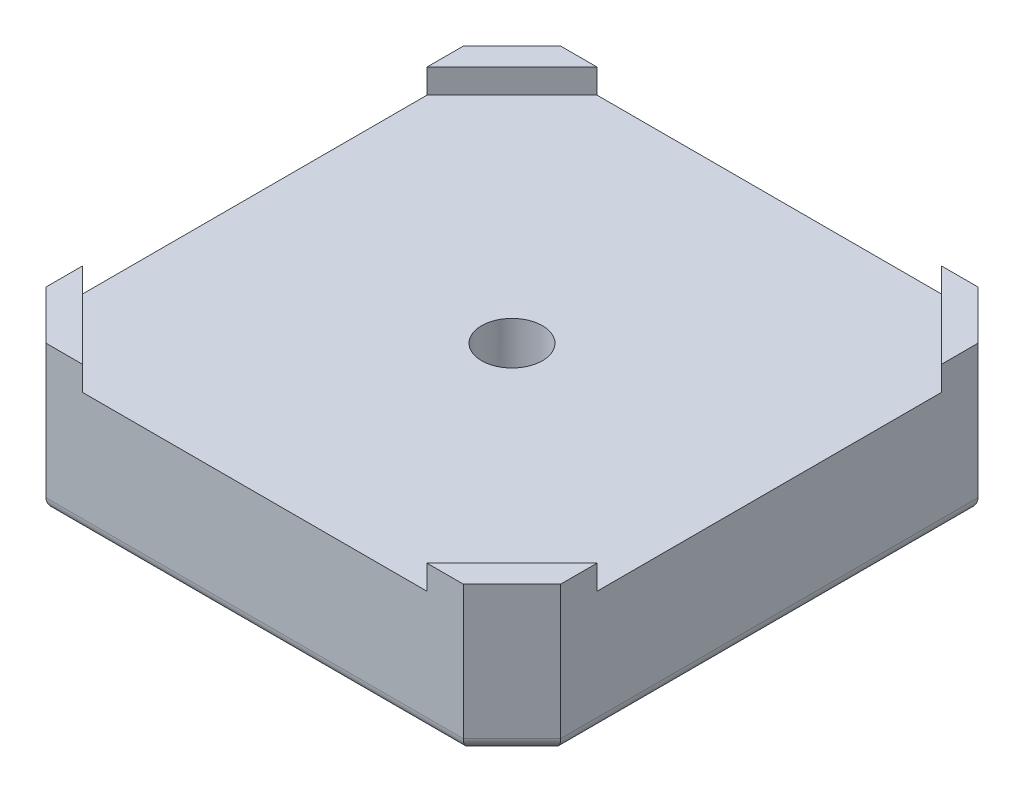
ISO-10303-21;
HEADER;
FILE_DESCRIPTION(('STEP AP214'),'2;1');
FILE_NAME('part.step','',(''),(''),'','','');
FILE_SCHEMA(('AUTOMOTIVE_DESIGN { 1 0 10303 214 1 1 1 1 }'));
ENDSEC;
DATA;
#1=APPLICATION_CONTEXT('core data for automotive mechanical design processes');
#2=APPLICATION_PROTOCOL_DEFINITION('international standard','automotive_design',2000,#1);
#3=PRODUCT_CONTEXT('',#1,'mechanical');
#4=PRODUCT('Part','Part','',(#3));
#5=PRODUCT_RELATED_PRODUCT_CATEGORY('part','',(#4));
#6=PRODUCT_DEFINITION_FORMATION('','',#4);
#7=PRODUCT_DEFINITION_CONTEXT('part definition',#1,'design');
#8=PRODUCT_DEFINITION('design','',#6,#7);
#9=PRODUCT_DEFINITION_SHAPE('','',#8);
#10=(LENGTH_UNIT() NAMED_UNIT(*) SI_UNIT(.MILLI.,.METRE.));
#11=(NAMED_UNIT(*) PLANE_ANGLE_UNIT() SI_UNIT($,.RADIAN.));
#12=(NAMED_UNIT(*) SI_UNIT($,.STERADIAN.) SOLID_ANGLE_UNIT());
#13=UNCERTAINTY_MEASURE_WITH_UNIT(LENGTH_MEASURE(1.E-05),#10,'distance_accuracy_value','');
#14=(GEOMETRIC_REPRESENTATION_CONTEXT(3) GLOBAL_UNCERTAINTY_ASSIGNED_CONTEXT((#13)) GLOBAL_UNIT_ASSIGNED_CONTEXT((#10,
#11,#12)) REPRESENTATION_CONTEXT('',''));
#15=CARTESIAN_POINT('',(0.,0.,0.));
#16=DIRECTION('',(0.,0.,1.));
#17=DIRECTION('',(1.,0.,0.));
#18=AXIS2_PLACEMENT_3D('',#15,#16,#17);
#19=CARTESIAN_POINT('',(0.,0.,0.));
#20=DIRECTION('',(0.,1.,0.));
#21=DIRECTION('',(0.,0.,1.));
#22=AXIS2_PLACEMENT_3D('',#19,#20,#21);
#23=PLANE('',#22);
#24=CARTESIAN_POINT('',(15.5,0.,-15.5));
#25=DIRECTION('',(0.,1.,0.));
#26=DIRECTION('',(0.,0.,1.));
#27=AXIS2_PLACEMENT_3D('',#24,#25,#26);
#28=CIRCLE('',#27,1.55);
#29=CARTESIAN_POINT('',(15.5,0.,-13.95));
#30=VERTEX_POINT('',#29);
#31=EDGE_CURVE('E482',#30,#30,#28,.T.);
#32=ORIENTED_EDGE('',*,*,#31,.T.);
#33=EDGE_LOOP('',(#32));
#34=FACE_BOUND('',#33,.T.);
#35=CARTESIAN_POINT('',(15.5,0.,15.5));
#36=DIRECTION('',(0.,1.,0.));
#37=DIRECTION('',(0.,0.,1.));
#38=AXIS2_PLACEMENT_3D('',#35,#36,#37);
#39=CIRCLE('',#38,1.55);
#40=CARTESIAN_POINT('',(15.5,0.,17.05));
#41=VERTEX_POINT('',#40);
#42=EDGE_CURVE('E478',#41,#41,#39,.T.);
#43=ORIENTED_EDGE('',*,*,#42,.T.);
#44=EDGE_LOOP('',(#43));
#45=FACE_BOUND('',#44,.T.);
#46=CARTESIAN_POINT('',(-15.5,0.,-15.5));
#47=DIRECTION('',(0.,1.,0.));
#48=DIRECTION('',(0.,0.,1.));
#49=AXIS2_PLACEMENT_3D('',#46,#47,#48);
#50=CIRCLE('',#49,1.55);
#51=CARTESIAN_POINT('',(-15.5,0.,-13.95));
#52=VERTEX_POINT('',#51);
#53=EDGE_CURVE('E474',#52,#52,#50,.T.);
#54=ORIENTED_EDGE('',*,*,#53,.T.);
#55=EDGE_LOOP('',(#54));
#56=FACE_BOUND('',#55,.T.);
#57=CARTESIAN_POINT('',(-15.5,0.,15.5));
#58=DIRECTION('',(0.,1.,0.));
#59=DIRECTION('',(0.,0.,1.));
#60=AXIS2_PLACEMENT_3D('',#57,#58,#59);
#61=CIRCLE('',#60,1.55);
#62=CARTESIAN_POINT('',(-15.5,0.,17.05));
#63=VERTEX_POINT('',#62);
#64=EDGE_CURVE('E470',#63,#63,#61,.T.);
#65=ORIENTED_EDGE('',*,*,#64,.T.);
#66=EDGE_LOOP('',(#65));
#67=FACE_BOUND('',#66,.T.);
#68=CARTESIAN_POINT('',(0.,0.,0.));
#69=DIRECTION('',(0.,1.,0.));
#70=DIRECTION('',(0.,0.,1.));
#71=AXIS2_PLACEMENT_3D('',#68,#69,#70);
#72=CIRCLE('',#71,11.5);
#73=CARTESIAN_POINT('',(0.,0.,11.5));
#74=VERTEX_POINT('',#73);
#75=EDGE_CURVE('E462',#74,#74,#72,.T.);
#76=ORIENTED_EDGE('',*,*,#75,.T.);
#77=EDGE_LOOP('',(#76));
#78=FACE_BOUND('',#77,.T.);
#79=DIRECTION('',(0.,0.,1.));
#80=VECTOR('',#79,1.);
#81=CARTESIAN_POINT('',(-20.15,0.,0.));
#82=LINE('',#81,#80);
#83=CARTESIAN_POINT('',(-20.15,0.,16.7357864376269));
#84=VERTEX_POINT('',#83);
#85=CARTESIAN_POINT('',(-20.15,0.,-16.7357864376269));
#86=VERTEX_POINT('',#85);
#87=EDGE_CURVE('E370',#84,#86,#82,.F.);
#88=ORIENTED_EDGE('',*,*,#87,.T.);
#89=DIRECTION('',(-0.707106781186548,0.,0.707106781186548));
#90=VECTOR('',#89,1.);
#91=CARTESIAN_POINT('',(-18.4428932188135,0.,-18.4428932188135));
#92=LINE('',#91,#90);
#93=CARTESIAN_POINT('',(-16.7357864376269,0.,-20.15));
#94=VERTEX_POINT('',#93);
#95=EDGE_CURVE('E391',#86,#94,#92,.F.);
#96=ORIENTED_EDGE('',*,*,#95,.T.);
#97=DIRECTION('',(-1.,0.,0.));
#98=VECTOR('',#97,1.);
#99=CARTESIAN_POINT('',(0.,0.,-20.15));
#100=LINE('',#99,#98);
#101=CARTESIAN_POINT('',(16.7357864376269,0.,-20.15));
#102=VERTEX_POINT('',#101);
#103=EDGE_CURVE('E388',#94,#102,#100,.F.);
#104=ORIENTED_EDGE('',*,*,#103,.T.);
#105=DIRECTION('',(-0.707106781186548,0.,-0.707106781186548));
#106=VECTOR('',#105,1.);
#107=CARTESIAN_POINT('',(18.4428932188134,0.,-18.4428932188134));
#108=LINE('',#107,#106);
#109=CARTESIAN_POINT('',(20.15,0.,-16.7357864376269));
#110=VERTEX_POINT('',#109);
#111=EDGE_CURVE('E385',#102,#110,#108,.F.);
#112=ORIENTED_EDGE('',*,*,#111,.T.);
#113=DIRECTION('',(0.,0.,-1.));
#114=VECTOR('',#113,1.);
#115=CARTESIAN_POINT('',(20.15,0.,0.));
#116=LINE('',#115,#114);
#117=CARTESIAN_POINT('',(20.15,0.,16.7357864376269));
#118=VERTEX_POINT('',#117);
#119=EDGE_CURVE('E382',#110,#118,#116,.F.);
#120=ORIENTED_EDGE('',*,*,#119,.T.);
#121=DIRECTION('',(0.707106781186548,0.,-0.707106781186548));
#122=VECTOR('',#121,1.);
#123=CARTESIAN_POINT('',(18.4428932188134,0.,18.4428932188134));
#124=LINE('',#123,#122);
#125=CARTESIAN_POINT('',(16.7357864376269,0.,20.15));
#126=VERTEX_POINT('',#125);
#127=EDGE_CURVE('E379',#118,#126,#124,.F.);
#128=ORIENTED_EDGE('',*,*,#127,.T.);
#129=DIRECTION('',(1.,0.,0.));
#130=VECTOR('',#129,1.);
#131=CARTESIAN_POINT('',(0.,0.,20.15));
#132=LINE('',#131,#130);
#133=CARTESIAN_POINT('',(-16.7357864376269,0.,20.15));
#134=VERTEX_POINT('',#133);
#135=EDGE_CURVE('E376',#126,#134,#132,.F.);
#136=ORIENTED_EDGE('',*,*,#135,.T.);
#137=DIRECTION('',(0.707106781186548,0.,0.707106781186548));
#138=VECTOR('',#137,1.);
#139=CARTESIAN_POINT('',(-18.4428932188135,0.,18.4428932188135));
#140=LINE('',#139,#138);
#141=EDGE_CURVE('E373',#134,#84,#140,.F.);
#142=ORIENTED_EDGE('',*,*,#141,.T.);
#143=EDGE_LOOP('',(#88,#96,#104,#112,#120,#128,#136,#142));
#144=FACE_BOUND('',#143,.T.);
#145=ADVANCED_FACE('F44',(#34,#45,#56,#67,#78,#144),#23,.F.);
#146=CARTESIAN_POINT('',(0.,0.,0.));
#147=DIRECTION('',(0.,1.,0.));
#148=DIRECTION('',(0.,0.,1.));
#149=AXIS2_PLACEMENT_3D('',#146,#147,#148);
#150=CYLINDRICAL_SURFACE('',#149,2.5);
#151=CARTESIAN_POINT('',(0.,10.,0.));
#152=DIRECTION('',(0.,1.,0.));
#153=DIRECTION('',(0.,0.,1.));
#154=AXIS2_PLACEMENT_3D('',#151,#152,#153);
#155=CIRCLE('',#154,2.5);
#156=CARTESIAN_POINT('',(0.,10.,2.5));
#157=VERTEX_POINT('',#156);
#158=EDGE_CURVE('E249',#157,#157,#155,.T.);
#159=ORIENTED_EDGE('',*,*,#158,.T.);
#160=EDGE_LOOP('',(#159));
#161=FACE_BOUND('',#160,.T.);
#162=CARTESIAN_POINT('',(0.,5.,0.));
#163=DIRECTION('',(0.,-1.,0.));
#164=DIRECTION('',(0.,0.,-1.));
#165=AXIS2_PLACEMENT_3D('',#162,#163,#164);
#166=CIRCLE('',#165,2.5);
#167=CARTESIAN_POINT('',(0.,5.,-2.5));
#168=VERTEX_POINT('',#167);
#169=EDGE_CURVE('E247',#168,#168,#166,.F.);
#170=ORIENTED_EDGE('',*,*,#169,.F.);
#171=EDGE_LOOP('',(#170));
#172=FACE_BOUND('',#171,.T.);
#173=ADVANCED_FACE('F510',(#161,#172),#150,.F.);
#174=CARTESIAN_POINT('',(0.,12.,0.));
#175=DIRECTION('',(0.,1.,0.));
#176=DIRECTION('',(0.,0.,1.));
#177=AXIS2_PLACEMENT_3D('',#174,#175,#176);
#178=PLANE('',#177);
#179=DIRECTION('',(-0.707106781186547,0.,0.707106781186547));
#180=VECTOR('',#179,1.);
#181=CARTESIAN_POINT('',(-21.15,12.,-14.15));
#182=LINE('',#181,#180);
#183=CARTESIAN_POINT('',(-14.15,12.,-21.15));
#184=VERTEX_POINT('',#183);
#185=CARTESIAN_POINT('',(-21.15,12.,-14.15));
#186=VERTEX_POINT('',#185);
#187=EDGE_CURVE('E252',#184,#186,#182,.T.);
#188=ORIENTED_EDGE('',*,*,#187,.F.);
#189=DIRECTION('',(-1.,0.,0.));
#190=VECTOR('',#189,1.);
#191=CARTESIAN_POINT('',(-17.15,12.,-21.15));
#192=LINE('',#191,#190);
#193=CARTESIAN_POINT('',(-17.15,12.,-21.15));
#194=VERTEX_POINT('',#193);
#195=EDGE_CURVE('E291',#184,#194,#192,.T.);
#196=ORIENTED_EDGE('',*,*,#195,.T.);
#197=DIRECTION('',(-0.707106781186548,0.,0.707106781186548));
#198=VECTOR('',#197,1.);
#199=CARTESIAN_POINT('',(-21.15,12.,-17.15));
#200=LINE('',#199,#198);
#201=CARTESIAN_POINT('',(-21.15,12.,-17.15));
#202=VERTEX_POINT('',#201);
#203=EDGE_CURVE('E315',#194,#202,#200,.T.);
#204=ORIENTED_EDGE('',*,*,#203,.T.);
#205=DIRECTION('',(0.,0.,1.));
#206=VECTOR('',#205,1.);
#207=CARTESIAN_POINT('',(-21.15,12.,17.15));
#208=LINE('',#207,#206);
#209=EDGE_CURVE('E318',#202,#186,#208,.T.);
#210=ORIENTED_EDGE('',*,*,#209,.T.);
#211=EDGE_LOOP('',(#188,#196,#204,#210));
#212=FACE_BOUND('',#211,.T.);
#213=ADVANCED_FACE('F516',(#212),#178,.T.);
#214=DIRECTION('',(-0.707106781186547,0.,-0.707106781186547));
#215=VECTOR('',#214,1.);
#216=CARTESIAN_POINT('',(21.15,12.,-14.15));
#217=LINE('',#216,#215);
#218=CARTESIAN_POINT('',(21.15,12.,-14.15));
#219=VERTEX_POINT('',#218);
#220=CARTESIAN_POINT('',(14.15,12.,-21.15));
#221=VERTEX_POINT('',#220);
#222=EDGE_CURVE('E257',#219,#221,#217,.T.);
#223=ORIENTED_EDGE('',*,*,#222,.F.);
#224=DIRECTION('',(0.,0.,-1.));
#225=VECTOR('',#224,1.);
#226=CARTESIAN_POINT('',(21.15,12.,17.15));
#227=LINE('',#226,#225);
#228=CARTESIAN_POINT('',(21.15,12.,-17.15));
#229=VERTEX_POINT('',#228);
#230=EDGE_CURVE('E329',#219,#229,#227,.T.);
#231=ORIENTED_EDGE('',*,*,#230,.T.);
#232=DIRECTION('',(-0.707106781186548,0.,-0.707106781186548));
#233=VECTOR('',#232,1.);
#234=CARTESIAN_POINT('',(21.15,12.,-17.15));
#235=LINE('',#234,#233);
#236=CARTESIAN_POINT('',(17.15,12.,-21.15));
#237=VERTEX_POINT('',#236);
#238=EDGE_CURVE('E333',#229,#237,#235,.T.);
#239=ORIENTED_EDGE('',*,*,#238,.T.);
#240=EDGE_CURVE('E311',#237,#221,#192,.T.);
#241=ORIENTED_EDGE('',*,*,#240,.T.);
#242=EDGE_LOOP('',(#223,#231,#239,#241));
#243=FACE_BOUND('',#242,.T.);
#244=ADVANCED_FACE('F705',(#243),#178,.T.);
#245=DIRECTION('',(0.707106781186547,0.,-0.707106781186547));
#246=VECTOR('',#245,1.);
#247=CARTESIAN_POINT('',(14.15,12.,21.15));
#248=LINE('',#247,#246);
#249=CARTESIAN_POINT('',(14.15,12.,21.15));
#250=VERTEX_POINT('',#249);
#251=CARTESIAN_POINT('',(21.15,12.,14.15));
#252=VERTEX_POINT('',#251);
#253=EDGE_CURVE('E285',#250,#252,#248,.T.);
#254=ORIENTED_EDGE('',*,*,#253,.F.);
#255=DIRECTION('',(1.,0.,0.));
#256=VECTOR('',#255,1.);
#257=CARTESIAN_POINT('',(-17.15,12.,21.15));
#258=LINE('',#257,#256);
#259=CARTESIAN_POINT('',(17.15,12.,21.15));
#260=VERTEX_POINT('',#259);
#261=EDGE_CURVE('E323',#250,#260,#258,.T.);
#262=ORIENTED_EDGE('',*,*,#261,.T.);
#263=DIRECTION('',(0.707106781186548,0.,-0.707106781186548));
#264=VECTOR('',#263,1.);
#265=CARTESIAN_POINT('',(17.15,12.,21.15));
#266=LINE('',#265,#264);
#267=CARTESIAN_POINT('',(21.15,12.,17.15));
#268=VERTEX_POINT('',#267);
#269=EDGE_CURVE('E327',#260,#268,#266,.T.);
#270=ORIENTED_EDGE('',*,*,#269,.T.);
#271=EDGE_CURVE('E330',#268,#252,#227,.T.);
#272=ORIENTED_EDGE('',*,*,#271,.T.);
#273=EDGE_LOOP('',(#254,#262,#270,#272));
#274=FACE_BOUND('',#273,.T.);
#275=ADVANCED_FACE('F553',(#274),#178,.T.);
#276=CARTESIAN_POINT('',(-17.15,12.,-21.15));
#277=DIRECTION('',(0.,0.,1.));
#278=DIRECTION('',(1.,0.,0.));
#279=AXIS2_PLACEMENT_3D('',#276,#277,#278);
#280=PLANE('',#279);
#281=DIRECTION('',(0.,-1.,0.));
#282=VECTOR('',#281,1.);
#283=CARTESIAN_POINT('',(17.15,12.,-21.15));
#284=LINE('',#283,#282);
#285=CARTESIAN_POINT('',(17.15,1.,-21.15));
#286=VERTEX_POINT('',#285);
#287=EDGE_CURVE('E336',#237,#286,#284,.T.);
#288=ORIENTED_EDGE('',*,*,#287,.T.);
#289=DIRECTION('',(-1.,0.,0.));
#290=VECTOR('',#289,1.);
#291=CARTESIAN_POINT('',(-17.15,1.,-21.15));
#292=LINE('',#291,#290);
#293=CARTESIAN_POINT('',(-17.15,1.,-21.15));
#294=VERTEX_POINT('',#293);
#295=EDGE_CURVE('E395',#286,#294,#292,.T.);
#296=ORIENTED_EDGE('',*,*,#295,.T.);
#297=DIRECTION('',(0.,-1.,0.));
#298=VECTOR('',#297,1.);
#299=CARTESIAN_POINT('',(-17.15,12.,-21.15));
#300=LINE('',#299,#298);
#301=EDGE_CURVE('E360',#194,#294,#300,.T.);
#302=ORIENTED_EDGE('',*,*,#301,.F.);
#303=ORIENTED_EDGE('',*,*,#195,.F.);
#304=DIRECTION('',(0.,1.,0.));
#305=VECTOR('',#304,1.);
#306=CARTESIAN_POINT('',(-14.15,10.,-21.15));
#307=LINE('',#306,#305);
#308=CARTESIAN_POINT('',(-14.15,10.,-21.15));
#309=VERTEX_POINT('',#308);
#310=EDGE_CURVE('E289',#309,#184,#307,.T.);
#311=ORIENTED_EDGE('',*,*,#310,.F.);
#312=DIRECTION('',(-1.,0.,0.));
#313=VECTOR('',#312,1.);
#314=CARTESIAN_POINT('',(-14.15,10.,-21.15));
#315=LINE('',#314,#313);
#316=CARTESIAN_POINT('',(14.15,10.,-21.15));
#317=VERTEX_POINT('',#316);
#318=EDGE_CURVE('E277',#317,#309,#315,.T.);
#319=ORIENTED_EDGE('',*,*,#318,.F.);
#320=DIRECTION('',(0.,1.,0.));
#321=VECTOR('',#320,1.);
#322=CARTESIAN_POINT('',(14.15,10.,-21.15));
#323=LINE('',#322,#321);
#324=EDGE_CURVE('E292',#317,#221,#323,.T.);
#325=ORIENTED_EDGE('',*,*,#324,.T.);
#326=ORIENTED_EDGE('',*,*,#240,.F.);
#327=EDGE_LOOP('',(#288,#296,#302,#303,#311,#319,#325,#326));
#328=FACE_BOUND('',#327,.T.);
#329=ADVANCED_FACE('F549',(#328),#280,.F.);
#330=CARTESIAN_POINT('',(-21.15,12.,-17.15));
#331=DIRECTION('',(0.707106781186547,0.,0.707106781186547));
#332=DIRECTION('',(0.707106781186548,0.,-0.707106781186548));
#333=AXIS2_PLACEMENT_3D('',#330,#331,#332);
#334=PLANE('',#333);
#335=ORIENTED_EDGE('',*,*,#301,.T.);
#336=DIRECTION('',(-0.707106781186548,0.,0.707106781186548));
#337=VECTOR('',#336,1.);
#338=CARTESIAN_POINT('',(-21.15,1.,-17.15));
#339=LINE('',#338,#337);
#340=CARTESIAN_POINT('',(-21.15,1.,-17.15));
#341=VERTEX_POINT('',#340);
#342=EDGE_CURVE('E364',#294,#341,#339,.T.);
#343=ORIENTED_EDGE('',*,*,#342,.T.);
#344=DIRECTION('',(0.,-1.,0.));
#345=VECTOR('',#344,1.);
#346=CARTESIAN_POINT('',(-21.15,12.,-17.15));
#347=LINE('',#346,#345);
#348=EDGE_CURVE('E357',#202,#341,#347,.T.);
#349=ORIENTED_EDGE('',*,*,#348,.F.);
#350=ORIENTED_EDGE('',*,*,#203,.F.);
#351=EDGE_LOOP('',(#335,#343,#349,#350));
#352=FACE_BOUND('',#351,.T.);
#353=ADVANCED_FACE('F546',(#352),#334,.F.);
#354=CARTESIAN_POINT('',(-21.15,12.,17.15));
#355=DIRECTION('',(1.,0.,0.));
#356=DIRECTION('',(0.,0.,-1.));
#357=AXIS2_PLACEMENT_3D('',#354,#355,#356);
#358=PLANE('',#357);
#359=ORIENTED_EDGE('',*,*,#348,.T.);
#360=DIRECTION('',(0.,0.,1.));
#361=VECTOR('',#360,1.);
#362=CARTESIAN_POINT('',(-21.15,1.,17.15));
#363=LINE('',#362,#361);
#364=CARTESIAN_POINT('',(-21.15,1.,17.15));
#365=VERTEX_POINT('',#364);
#366=EDGE_CURVE('E63',#341,#365,#363,.T.);
#367=ORIENTED_EDGE('',*,*,#366,.T.);
#368=DIRECTION('',(0.,-1.,0.));
#369=VECTOR('',#368,1.);
#370=CARTESIAN_POINT('',(-21.15,12.,17.15));
#371=LINE('',#370,#369);
#372=CARTESIAN_POINT('',(-21.15,12.,17.15));
#373=VERTEX_POINT('',#372);
#374=EDGE_CURVE('E354',#373,#365,#371,.T.);
#375=ORIENTED_EDGE('',*,*,#374,.F.);
#376=CARTESIAN_POINT('',(-21.15,12.,14.15));
#377=VERTEX_POINT('',#376);
#378=EDGE_CURVE('E317',#377,#373,#208,.T.);
#379=ORIENTED_EDGE('',*,*,#378,.F.);
#380=DIRECTION('',(0.,1.,0.));
#381=VECTOR('',#380,1.);
#382=CARTESIAN_POINT('',(-21.15,10.,14.15));
#383=LINE('',#382,#381);
#384=CARTESIAN_POINT('',(-21.15,10.,14.15));
#385=VERTEX_POINT('',#384);
#386=EDGE_CURVE('E307',#385,#377,#383,.T.);
#387=ORIENTED_EDGE('',*,*,#386,.F.);
#388=DIRECTION('',(0.,0.,1.));
#389=VECTOR('',#388,1.);
#390=CARTESIAN_POINT('',(-21.15,10.,14.15));
#391=LINE('',#390,#389);
#392=CARTESIAN_POINT('',(-21.15,10.,-14.15));
#393=VERTEX_POINT('',#392);
#394=EDGE_CURVE('E256',#393,#385,#391,.T.);
#395=ORIENTED_EDGE('',*,*,#394,.F.);
#396=DIRECTION('',(0.,1.,0.));
#397=VECTOR('',#396,1.);
#398=CARTESIAN_POINT('',(-21.15,10.,-14.15));
#399=LINE('',#398,#397);
#400=EDGE_CURVE('E281',#393,#186,#399,.T.);
#401=ORIENTED_EDGE('',*,*,#400,.T.);
#402=ORIENTED_EDGE('',*,*,#209,.F.);
#403=EDGE_LOOP('',(#359,#367,#375,#379,#387,#395,#401,#402));
#404=FACE_BOUND('',#403,.T.);
#405=ADVANCED_FACE('F543',(#404),#358,.F.);
#406=CARTESIAN_POINT('',(-21.15,12.,17.15));
#407=DIRECTION('',(0.707106781186547,0.,-0.707106781186547));
#408=DIRECTION('',(-0.707106781186548,0.,-0.707106781186548));
#409=AXIS2_PLACEMENT_3D('',#406,#407,#408);
#410=PLANE('',#409);
#411=ORIENTED_EDGE('',*,*,#374,.T.);
#412=DIRECTION('',(0.707106781186548,0.,0.707106781186548));
#413=VECTOR('',#412,1.);
#414=CARTESIAN_POINT('',(-21.15,1.,17.15));
#415=LINE('',#414,#413);
#416=CARTESIAN_POINT('',(-17.15,1.,21.15));
#417=VERTEX_POINT('',#416);
#418=EDGE_CURVE('E72',#365,#417,#415,.T.);
#419=ORIENTED_EDGE('',*,*,#418,.T.);
#420=DIRECTION('',(0.,-1.,0.));
#421=VECTOR('',#420,1.);
#422=CARTESIAN_POINT('',(-17.15,12.,21.15));
#423=LINE('',#422,#421);
#424=CARTESIAN_POINT('',(-17.15,12.,21.15));
#425=VERTEX_POINT('',#424);
#426=EDGE_CURVE('E351',#425,#417,#423,.T.);
#427=ORIENTED_EDGE('',*,*,#426,.F.);
#428=DIRECTION('',(0.707106781186548,0.,0.707106781186548));
#429=VECTOR('',#428,1.);
#430=CARTESIAN_POINT('',(-21.15,12.,17.15));
#431=LINE('',#430,#429);
#432=EDGE_CURVE('E321',#373,#425,#431,.T.);
#433=ORIENTED_EDGE('',*,*,#432,.F.);
#434=EDGE_LOOP('',(#411,#419,#427,#433));
#435=FACE_BOUND('',#434,.T.);
#436=ADVANCED_FACE('F539',(#435),#410,.F.);
#437=CARTESIAN_POINT('',(-17.15,12.,21.15));
#438=DIRECTION('',(0.,0.,-1.));
#439=DIRECTION('',(-1.,0.,0.));
#440=AXIS2_PLACEMENT_3D('',#437,#438,#439);
#441=PLANE('',#440);
#442=ORIENTED_EDGE('',*,*,#426,.T.);
#443=DIRECTION('',(1.,0.,0.));
#444=VECTOR('',#443,1.);
#445=CARTESIAN_POINT('',(-17.15,1.,21.15));
#446=LINE('',#445,#444);
#447=CARTESIAN_POINT('',(17.15,1.,21.15));
#448=VERTEX_POINT('',#447);
#449=EDGE_CURVE('E407',#417,#448,#446,.T.);
#450=ORIENTED_EDGE('',*,*,#449,.T.);
#451=DIRECTION('',(0.,-1.,0.));
#452=VECTOR('',#451,1.);
#453=CARTESIAN_POINT('',(17.15,12.,21.15));
#454=LINE('',#453,#452);
#455=EDGE_CURVE('E347',#260,#448,#454,.T.);
#456=ORIENTED_EDGE('',*,*,#455,.F.);
#457=ORIENTED_EDGE('',*,*,#261,.F.);
#458=DIRECTION('',(0.,1.,0.));
#459=VECTOR('',#458,1.);
#460=CARTESIAN_POINT('',(14.15,10.,21.15));
#461=LINE('',#460,#459);
#462=CARTESIAN_POINT('',(14.15,10.,21.15));
#463=VERTEX_POINT('',#462);
#464=EDGE_CURVE('E302',#463,#250,#461,.T.);
#465=ORIENTED_EDGE('',*,*,#464,.F.);
#466=DIRECTION('',(1.,0.,0.));
#467=VECTOR('',#466,1.);
#468=CARTESIAN_POINT('',(-14.15,10.,21.15));
#469=LINE('',#468,#467);
#470=CARTESIAN_POINT('',(-14.15,10.,21.15));
#471=VERTEX_POINT('',#470);
#472=EDGE_CURVE('E263',#471,#463,#469,.T.);
#473=ORIENTED_EDGE('',*,*,#472,.F.);
#474=DIRECTION('',(0.,1.,0.));
#475=VECTOR('',#474,1.);
#476=CARTESIAN_POINT('',(-14.15,10.,21.15));
#477=LINE('',#476,#475);
#478=CARTESIAN_POINT('',(-14.15,12.,21.15));
#479=VERTEX_POINT('',#478);
#480=EDGE_CURVE('E304',#471,#479,#477,.T.);
#481=ORIENTED_EDGE('',*,*,#480,.T.);
#482=EDGE_CURVE('E324',#425,#479,#258,.T.);
#483=ORIENTED_EDGE('',*,*,#482,.F.);
#484=EDGE_LOOP('',(#442,#450,#456,#457,#465,#473,#481,#483));
#485=FACE_BOUND('',#484,.T.);
#486=ADVANCED_FACE('F535',(#485),#441,.F.);
#487=CARTESIAN_POINT('',(17.15,12.,21.15));
#488=DIRECTION('',(-0.707106781186547,0.,-0.707106781186547));
#489=DIRECTION('',(-0.707106781186548,0.,0.707106781186548));
#490=AXIS2_PLACEMENT_3D('',#487,#488,#489);
#491=PLANE('',#490);
#492=ORIENTED_EDGE('',*,*,#455,.T.);
#493=DIRECTION('',(0.707106781186548,0.,-0.707106781186548));
#494=VECTOR('',#493,1.);
#495=CARTESIAN_POINT('',(17.15,1.,21.15));
#496=LINE('',#495,#494);
#497=CARTESIAN_POINT('',(21.15,1.,17.15));
#498=VERTEX_POINT('',#497);
#499=EDGE_CURVE('E404',#448,#498,#496,.T.);
#500=ORIENTED_EDGE('',*,*,#499,.T.);
#501=DIRECTION('',(0.,-1.,0.));
#502=VECTOR('',#501,1.);
#503=CARTESIAN_POINT('',(21.15,12.,17.15));
#504=LINE('',#503,#502);
#505=EDGE_CURVE('E344',#268,#498,#504,.T.);
#506=ORIENTED_EDGE('',*,*,#505,.F.);
#507=ORIENTED_EDGE('',*,*,#269,.F.);
#508=EDGE_LOOP('',(#492,#500,#506,#507));
#509=FACE_BOUND('',#508,.T.);
#510=ADVANCED_FACE('F531',(#509),#491,.F.);
#511=CARTESIAN_POINT('',(21.15,12.,17.15));
#512=DIRECTION('',(-1.,0.,0.));
#513=DIRECTION('',(0.,0.,1.));
#514=AXIS2_PLACEMENT_3D('',#511,#512,#513);
#515=PLANE('',#514);
#516=ORIENTED_EDGE('',*,*,#505,.T.);
#517=DIRECTION('',(0.,0.,-1.));
#518=VECTOR('',#517,1.);
#519=CARTESIAN_POINT('',(21.15,1.,17.15));
#520=LINE('',#519,#518);
#521=CARTESIAN_POINT('',(21.15,1.,-17.15));
#522=VERTEX_POINT('',#521);
#523=EDGE_CURVE('E401',#498,#522,#520,.T.);
#524=ORIENTED_EDGE('',*,*,#523,.T.);
#525=DIRECTION('',(0.,-1.,0.));
#526=VECTOR('',#525,1.);
#527=CARTESIAN_POINT('',(21.15,12.,-17.15));
#528=LINE('',#527,#526);
#529=EDGE_CURVE('E340',#229,#522,#528,.T.);
#530=ORIENTED_EDGE('',*,*,#529,.F.);
#531=ORIENTED_EDGE('',*,*,#230,.F.);
#532=DIRECTION('',(0.,1.,0.));
#533=VECTOR('',#532,1.);
#534=CARTESIAN_POINT('',(21.15,10.,-14.15));
#535=LINE('',#534,#533);
#536=CARTESIAN_POINT('',(21.15,10.,-14.15));
#537=VERTEX_POINT('',#536);
#538=EDGE_CURVE('E296',#537,#219,#535,.T.);
#539=ORIENTED_EDGE('',*,*,#538,.F.);
#540=DIRECTION('',(0.,0.,-1.));
#541=VECTOR('',#540,1.);
#542=CARTESIAN_POINT('',(21.15,10.,14.15));
#543=LINE('',#542,#541);
#544=CARTESIAN_POINT('',(21.15,10.,14.15));
#545=VERTEX_POINT('',#544);
#546=EDGE_CURVE('E269',#545,#537,#543,.T.);
#547=ORIENTED_EDGE('',*,*,#546,.F.);
#548=DIRECTION('',(0.,1.,0.));
#549=VECTOR('',#548,1.);
#550=CARTESIAN_POINT('',(21.15,10.,14.15));
#551=LINE('',#550,#549);
#552=EDGE_CURVE('E299',#545,#252,#551,.T.);
#553=ORIENTED_EDGE('',*,*,#552,.T.);
#554=ORIENTED_EDGE('',*,*,#271,.F.);
#555=EDGE_LOOP('',(#516,#524,#530,#531,#539,#547,#553,#554));
#556=FACE_BOUND('',#555,.T.);
#557=ADVANCED_FACE('F527',(#556),#515,.F.);
#558=CARTESIAN_POINT('',(21.15,12.,-17.15));
#559=DIRECTION('',(-0.707106781186547,0.,0.707106781186547));
#560=DIRECTION('',(0.707106781186548,0.,0.707106781186548));
#561=AXIS2_PLACEMENT_3D('',#558,#559,#560);
#562=PLANE('',#561);
#563=ORIENTED_EDGE('',*,*,#529,.T.);
#564=DIRECTION('',(-0.707106781186548,0.,-0.707106781186548));
#565=VECTOR('',#564,1.);
#566=CARTESIAN_POINT('',(21.15,1.,-17.15));
#567=LINE('',#566,#565);
#568=EDGE_CURVE('E398',#522,#286,#567,.T.);
#569=ORIENTED_EDGE('',*,*,#568,.T.);
#570=ORIENTED_EDGE('',*,*,#287,.F.);
#571=ORIENTED_EDGE('',*,*,#238,.F.);
#572=EDGE_LOOP('',(#563,#569,#570,#571));
#573=FACE_BOUND('',#572,.T.);
#574=ADVANCED_FACE('F524',(#573),#562,.F.);
#575=DIRECTION('',(0.707106781186547,0.,0.707106781186547));
#576=VECTOR('',#575,1.);
#577=CARTESIAN_POINT('',(-21.15,12.,14.15));
#578=LINE('',#577,#576);
#579=EDGE_CURVE('E283',#377,#479,#578,.T.);
#580=ORIENTED_EDGE('',*,*,#579,.F.);
#581=ORIENTED_EDGE('',*,*,#378,.T.);
#582=ORIENTED_EDGE('',*,*,#432,.T.);
#583=ORIENTED_EDGE('',*,*,#482,.T.);
#584=EDGE_LOOP('',(#580,#581,#582,#583));
#585=FACE_BOUND('',#584,.T.);
#586=ADVANCED_FACE('F522',(#585),#178,.T.);
#587=CARTESIAN_POINT('',(-21.15,10.,-14.15));
#588=DIRECTION('',(-0.707106781186547,0.,-0.707106781186547));
#589=DIRECTION('',(-0.707106781186548,0.,0.707106781186548));
#590=AXIS2_PLACEMENT_3D('',#587,#588,#589);
#591=PLANE('',#590);
#592=ORIENTED_EDGE('',*,*,#187,.T.);
#593=ORIENTED_EDGE('',*,*,#400,.F.);
#594=DIRECTION('',(-0.707106781186547,0.,0.707106781186547));
#595=VECTOR('',#594,1.);
#596=CARTESIAN_POINT('',(-21.15,10.,-14.15));
#597=LINE('',#596,#595);
#598=EDGE_CURVE('E253',#309,#393,#597,.T.);
#599=ORIENTED_EDGE('',*,*,#598,.F.);
#600=ORIENTED_EDGE('',*,*,#310,.T.);
#601=EDGE_LOOP('',(#592,#593,#599,#600));
#602=FACE_BOUND('',#601,.T.);
#603=ADVANCED_FACE('F650',(#602),#591,.F.);
#604=CARTESIAN_POINT('',(21.15,10.,-14.15));
#605=DIRECTION('',(0.707106781186547,0.,-0.707106781186547));
#606=DIRECTION('',(-0.707106781186548,0.,-0.707106781186548));
#607=AXIS2_PLACEMENT_3D('',#604,#605,#606);
#608=PLANE('',#607);
#609=ORIENTED_EDGE('',*,*,#222,.T.);
#610=ORIENTED_EDGE('',*,*,#324,.F.);
#611=DIRECTION('',(-0.707106781186547,0.,-0.707106781186547));
#612=VECTOR('',#611,1.);
#613=CARTESIAN_POINT('',(21.15,10.,-14.15));
#614=LINE('',#613,#612);
#615=EDGE_CURVE('E273',#537,#317,#614,.T.);
#616=ORIENTED_EDGE('',*,*,#615,.F.);
#617=ORIENTED_EDGE('',*,*,#538,.T.);
#618=EDGE_LOOP('',(#609,#610,#616,#617));
#619=FACE_BOUND('',#618,.T.);
#620=ADVANCED_FACE('F646',(#619),#608,.F.);
#621=CARTESIAN_POINT('',(14.15,10.,21.15));
#622=DIRECTION('',(0.707106781186547,0.,0.707106781186547));
#623=DIRECTION('',(0.707106781186548,0.,-0.707106781186548));
#624=AXIS2_PLACEMENT_3D('',#621,#622,#623);
#625=PLANE('',#624);
#626=ORIENTED_EDGE('',*,*,#253,.T.);
#627=ORIENTED_EDGE('',*,*,#552,.F.);
#628=DIRECTION('',(0.707106781186547,0.,-0.707106781186547));
#629=VECTOR('',#628,1.);
#630=CARTESIAN_POINT('',(14.15,10.,21.15));
#631=LINE('',#630,#629);
#632=EDGE_CURVE('E266',#463,#545,#631,.T.);
#633=ORIENTED_EDGE('',*,*,#632,.F.);
#634=ORIENTED_EDGE('',*,*,#464,.T.);
#635=EDGE_LOOP('',(#626,#627,#633,#634));
#636=FACE_BOUND('',#635,.T.);
#637=ADVANCED_FACE('F649',(#636),#625,.F.);
#638=CARTESIAN_POINT('',(-21.15,10.,14.15));
#639=DIRECTION('',(-0.707106781186547,0.,0.707106781186547));
#640=DIRECTION('',(0.707106781186548,0.,0.707106781186548));
#641=AXIS2_PLACEMENT_3D('',#638,#639,#640);
#642=PLANE('',#641);
#643=ORIENTED_EDGE('',*,*,#579,.T.);
#644=ORIENTED_EDGE('',*,*,#480,.F.);
#645=DIRECTION('',(0.707106781186547,0.,0.707106781186547));
#646=VECTOR('',#645,1.);
#647=CARTESIAN_POINT('',(-21.15,10.,14.15));
#648=LINE('',#647,#646);
#649=EDGE_CURVE('E260',#385,#471,#648,.T.);
#650=ORIENTED_EDGE('',*,*,#649,.F.);
#651=ORIENTED_EDGE('',*,*,#386,.T.);
#652=EDGE_LOOP('',(#643,#644,#650,#651));
#653=FACE_BOUND('',#652,.T.);
#654=ADVANCED_FACE('F644',(#653),#642,.F.);
#655=CARTESIAN_POINT('',(0.,10.,0.));
#656=DIRECTION('',(0.,1.,0.));
#657=DIRECTION('',(0.,0.,1.));
#658=AXIS2_PLACEMENT_3D('',#655,#656,#657);
#659=PLANE('',#658);
#660=ORIENTED_EDGE('',*,*,#158,.F.);
#661=EDGE_LOOP('',(#660));
#662=FACE_BOUND('',#661,.T.);
#663=ORIENTED_EDGE('',*,*,#598,.T.);
#664=ORIENTED_EDGE('',*,*,#394,.T.);
#665=ORIENTED_EDGE('',*,*,#649,.T.);
#666=ORIENTED_EDGE('',*,*,#472,.T.);
#667=ORIENTED_EDGE('',*,*,#632,.T.);
#668=ORIENTED_EDGE('',*,*,#546,.T.);
#669=ORIENTED_EDGE('',*,*,#615,.T.);
#670=ORIENTED_EDGE('',*,*,#318,.T.);
#671=EDGE_LOOP('',(#663,#664,#665,#666,#667,#668,#669,#670));
#672=FACE_BOUND('',#671,.T.);
#673=ADVANCED_FACE('F637',(#662,#672),#659,.T.);
#674=CARTESIAN_POINT('',(0.,5.,0.));
#675=DIRECTION('',(0.,-1.,0.));
#676=DIRECTION('',(0.,0.,-1.));
#677=AXIS2_PLACEMENT_3D('',#674,#675,#676);
#678=PLANE('',#677);
#679=CARTESIAN_POINT('',(0.,5.,0.));
#680=DIRECTION('',(0.,-1.,0.));
#681=DIRECTION('',(0.,0.,-1.));
#682=AXIS2_PLACEMENT_3D('',#679,#680,#681);
#683=CIRCLE('',#682,5.5);
#684=CARTESIAN_POINT('',(0.,5.,-5.5));
#685=VERTEX_POINT('',#684);
#686=EDGE_CURVE('E244',#685,#685,#683,.T.);
#687=ORIENTED_EDGE('',*,*,#686,.T.);
#688=EDGE_LOOP('',(#687));
#689=FACE_BOUND('',#688,.T.);
#690=ORIENTED_EDGE('',*,*,#169,.T.);
#691=EDGE_LOOP('',(#690));
#692=FACE_BOUND('',#691,.T.);
#693=ADVANCED_FACE('F634',(#689,#692),#678,.T.);
#694=CARTESIAN_POINT('',(0.,5.,0.));
#695=DIRECTION('',(0.,-1.,0.));
#696=DIRECTION('',(0.,0.,-1.));
#697=AXIS2_PLACEMENT_3D('',#694,#695,#696);
#698=CYLINDRICAL_SURFACE('',#697,5.5);
#699=CARTESIAN_POINT('',(0.,-1.5,0.));
#700=DIRECTION('',(0.,-1.,0.));
#701=DIRECTION('',(0.,0.,-1.));
#702=AXIS2_PLACEMENT_3D('',#699,#700,#701);
#703=CIRCLE('',#702,5.5);
#704=CARTESIAN_POINT('',(0.,-1.5,-5.5));
#705=VERTEX_POINT('',#704);
#706=EDGE_CURVE('E414',#705,#705,#703,.T.);
#707=ORIENTED_EDGE('',*,*,#706,.T.);
#708=EDGE_LOOP('',(#707));
#709=FACE_BOUND('',#708,.T.);
#710=ORIENTED_EDGE('',*,*,#686,.F.);
#711=EDGE_LOOP('',(#710));
#712=FACE_BOUND('',#711,.T.);
#713=ADVANCED_FACE('F629',(#709,#712),#698,.F.);
#714=CARTESIAN_POINT('',(0.,-2.,0.));
#715=DIRECTION('',(0.,-1.,0.));
#716=DIRECTION('',(0.,0.,-1.));
#717=AXIS2_PLACEMENT_3D('',#714,#715,#716);
#718=PLANE('',#717);
#719=CARTESIAN_POINT('',(0.,-2.,0.));
#720=DIRECTION('',(0.,-1.,0.));
#721=DIRECTION('',(0.,0.,-1.));
#722=AXIS2_PLACEMENT_3D('',#719,#720,#721);
#723=CIRCLE('',#722,6.);
#724=CARTESIAN_POINT('',(0.,-2.,-6.));
#725=VERTEX_POINT('',#724);
#726=EDGE_CURVE('E450',#725,#725,#723,.F.);
#727=ORIENTED_EDGE('',*,*,#726,.T.);
#728=EDGE_LOOP('',(#727));
#729=FACE_BOUND('',#728,.T.);
#730=CARTESIAN_POINT('',(0.,-2.,0.));
#731=DIRECTION('',(0.,-1.,0.));
#732=DIRECTION('',(0.,0.,-1.));
#733=AXIS2_PLACEMENT_3D('',#730,#731,#732);
#734=CIRCLE('',#733,10.5);
#735=CARTESIAN_POINT('',(0.,-2.,-10.5));
#736=VERTEX_POINT('',#735);
#737=EDGE_CURVE('E446',#736,#736,#734,.T.);
#738=ORIENTED_EDGE('',*,*,#737,.T.);
#739=EDGE_LOOP('',(#738));
#740=FACE_BOUND('',#739,.T.);
#741=ADVANCED_FACE('F626',(#729,#740),#718,.T.);
#742=CARTESIAN_POINT('',(0.,-2.,0.));
#743=DIRECTION('',(0.,1.,0.));
#744=DIRECTION('',(0.,0.,1.));
#745=AXIS2_PLACEMENT_3D('',#742,#743,#744);
#746=CYLINDRICAL_SURFACE('',#745,11.);
#747=CARTESIAN_POINT('',(0.,-1.5,0.));
#748=DIRECTION('',(0.,-1.,0.));
#749=DIRECTION('',(0.,0.,-1.));
#750=AXIS2_PLACEMENT_3D('',#747,#748,#749);
#751=CIRCLE('',#750,11.);
#752=CARTESIAN_POINT('',(0.,-1.5,-11.));
#753=VERTEX_POINT('',#752);
#754=EDGE_CURVE('E458',#753,#753,#751,.F.);
#755=ORIENTED_EDGE('',*,*,#754,.T.);
#756=EDGE_LOOP('',(#755));
#757=FACE_BOUND('',#756,.T.);
#758=CARTESIAN_POINT('',(0.,-0.5,0.));
#759=DIRECTION('',(0.,1.,0.));
#760=DIRECTION('',(0.,0.,1.));
#761=AXIS2_PLACEMENT_3D('',#758,#759,#760);
#762=CIRCLE('',#761,11.);
#763=CARTESIAN_POINT('',(0.,-0.5,11.));
#764=VERTEX_POINT('',#763);
#765=EDGE_CURVE('E454',#764,#764,#762,.F.);
#766=ORIENTED_EDGE('',*,*,#765,.T.);
#767=EDGE_LOOP('',(#766));
#768=FACE_BOUND('',#767,.T.);
#769=ADVANCED_FACE('F587',(#757,#768),#746,.T.);
#770=CARTESIAN_POINT('',(16.4428932188134,1.,20.4428932188134));
#771=DIRECTION('',(0.707106781186548,0.,-0.707106781186548));
#772=DIRECTION('',(-0.707106781186548,0.,-0.707106781186548));
#773=AXIS2_PLACEMENT_3D('',#770,#771,#772);
#774=CYLINDRICAL_SURFACE('',#773,1.);
#775=CARTESIAN_POINT('',(16.7357864376269,1.,20.15));
#776=DIRECTION('',(0.923879532511287,0.,-0.38268343236509));
#777=DIRECTION('',(0.38268343236509,0.,0.923879532511287));
#778=AXIS2_PLACEMENT_3D('',#775,#776,#777);
#779=ELLIPSE('',#778,1.08239220029239,1.);
#780=EDGE_CURVE('E436',#126,#448,#779,.F.);
#781=ORIENTED_EDGE('',*,*,#780,.F.);
#782=ORIENTED_EDGE('',*,*,#127,.F.);
#783=CARTESIAN_POINT('',(20.15,1.,16.7357864376269));
#784=DIRECTION('',(0.38268343236509,0.,-0.923879532511287));
#785=DIRECTION('',(0.923879532511287,0.,0.38268343236509));
#786=AXIS2_PLACEMENT_3D('',#783,#784,#785);
#787=ELLIPSE('',#786,1.08239220029239,1.);
#788=EDGE_CURVE('E248',#498,#118,#787,.T.);
#789=ORIENTED_EDGE('',*,*,#788,.F.);
#790=ORIENTED_EDGE('',*,*,#499,.F.);
#791=EDGE_LOOP('',(#781,#782,#789,#790));
#792=FACE_BOUND('',#791,.T.);
#793=ADVANCED_FACE('F583',(#792),#774,.T.);
#794=CARTESIAN_POINT('',(20.15,1.,17.15));
#795=DIRECTION('',(0.,0.,-1.));
#796=DIRECTION('',(-1.,0.,0.));
#797=AXIS2_PLACEMENT_3D('',#794,#795,#796);
#798=CYLINDRICAL_SURFACE('',#797,1.);
#799=ORIENTED_EDGE('',*,*,#788,.T.);
#800=ORIENTED_EDGE('',*,*,#119,.F.);
#801=CARTESIAN_POINT('',(20.15,1.,-16.7357864376269));
#802=DIRECTION('',(-0.38268343236509,0.,-0.923879532511287));
#803=DIRECTION('',(0.923879532511287,0.,-0.38268343236509));
#804=AXIS2_PLACEMENT_3D('',#801,#802,#803);
#805=ELLIPSE('',#804,1.08239220029239,1.);
#806=EDGE_CURVE('E432',#522,#110,#805,.T.);
#807=ORIENTED_EDGE('',*,*,#806,.F.);
#808=ORIENTED_EDGE('',*,*,#523,.F.);
#809=EDGE_LOOP('',(#799,#800,#807,#808));
#810=FACE_BOUND('',#809,.T.);
#811=ADVANCED_FACE('F579',(#810),#798,.T.);
#812=CARTESIAN_POINT('',(-17.15,1.,20.15));
#813=DIRECTION('',(1.,0.,0.));
#814=DIRECTION('',(0.,0.,-1.));
#815=AXIS2_PLACEMENT_3D('',#812,#813,#814);
#816=CYLINDRICAL_SURFACE('',#815,1.);
#817=ORIENTED_EDGE('',*,*,#780,.T.);
#818=ORIENTED_EDGE('',*,*,#449,.F.);
#819=CARTESIAN_POINT('',(-16.7357864376269,1.,20.15));
#820=DIRECTION('',(0.923879532511287,0.,0.38268343236509));
#821=DIRECTION('',(-0.38268343236509,0.,0.923879532511287));
#822=AXIS2_PLACEMENT_3D('',#819,#820,#821);
#823=ELLIPSE('',#822,1.08239220029239,1.);
#824=EDGE_CURVE('E428',#134,#417,#823,.F.);
#825=ORIENTED_EDGE('',*,*,#824,.F.);
#826=ORIENTED_EDGE('',*,*,#135,.F.);
#827=EDGE_LOOP('',(#817,#818,#825,#826));
#828=FACE_BOUND('',#827,.T.);
#829=ADVANCED_FACE('F575',(#828),#816,.T.);
#830=CARTESIAN_POINT('',(20.4428932188134,1.,-16.4428932188134));
#831=DIRECTION('',(-0.707106781186548,0.,-0.707106781186548));
#832=DIRECTION('',(-0.707106781186548,0.,0.707106781186548));
#833=AXIS2_PLACEMENT_3D('',#830,#831,#832);
#834=CYLINDRICAL_SURFACE('',#833,1.);
#835=ORIENTED_EDGE('',*,*,#806,.T.);
#836=ORIENTED_EDGE('',*,*,#111,.F.);
#837=CARTESIAN_POINT('',(16.7357864376269,1.,-20.15));
#838=DIRECTION('',(-0.923879532511287,0.,-0.38268343236509));
#839=DIRECTION('',(0.38268343236509,0.,-0.923879532511287));
#840=AXIS2_PLACEMENT_3D('',#837,#838,#839);
#841=ELLIPSE('',#840,1.08239220029239,1.);
#842=EDGE_CURVE('E424',#286,#102,#841,.T.);
#843=ORIENTED_EDGE('',*,*,#842,.F.);
#844=ORIENTED_EDGE('',*,*,#568,.F.);
#845=EDGE_LOOP('',(#835,#836,#843,#844));
#846=FACE_BOUND('',#845,.T.);
#847=ADVANCED_FACE('F571',(#846),#834,.T.);
#848=CARTESIAN_POINT('',(-20.4428932188135,1.,16.4428932188134));
#849=DIRECTION('',(0.707106781186548,0.,0.707106781186548));
#850=DIRECTION('',(0.707106781186548,0.,-0.707106781186548));
#851=AXIS2_PLACEMENT_3D('',#848,#849,#850);
#852=CYLINDRICAL_SURFACE('',#851,1.);
#853=ORIENTED_EDGE('',*,*,#824,.T.);
#854=ORIENTED_EDGE('',*,*,#418,.F.);
#855=CARTESIAN_POINT('',(-20.15,1.,16.7357864376269));
#856=DIRECTION('',(0.38268343236509,0.,0.923879532511287));
#857=DIRECTION('',(-0.923879532511287,0.,0.38268343236509));
#858=AXIS2_PLACEMENT_3D('',#855,#856,#857);
#859=ELLIPSE('',#858,1.08239220029239,1.);
#860=EDGE_CURVE('E420',#84,#365,#859,.F.);
#861=ORIENTED_EDGE('',*,*,#860,.F.);
#862=ORIENTED_EDGE('',*,*,#141,.F.);
#863=EDGE_LOOP('',(#853,#854,#861,#862));
#864=FACE_BOUND('',#863,.T.);
#865=ADVANCED_FACE('F567',(#864),#852,.T.);
#866=CARTESIAN_POINT('',(-17.15,1.,-20.15));
#867=DIRECTION('',(-1.,0.,0.));
#868=DIRECTION('',(0.,0.,1.));
#869=AXIS2_PLACEMENT_3D('',#866,#867,#868);
#870=CYLINDRICAL_SURFACE('',#869,1.);
#871=ORIENTED_EDGE('',*,*,#842,.T.);
#872=ORIENTED_EDGE('',*,*,#103,.F.);
#873=CARTESIAN_POINT('',(-16.7357864376269,1.,-20.15));
#874=DIRECTION('',(-0.923879532511287,0.,0.38268343236509));
#875=DIRECTION('',(-0.38268343236509,0.,-0.923879532511287));
#876=AXIS2_PLACEMENT_3D('',#873,#874,#875);
#877=ELLIPSE('',#876,1.08239220029239,1.);
#878=EDGE_CURVE('E417',#294,#94,#877,.T.);
#879=ORIENTED_EDGE('',*,*,#878,.F.);
#880=ORIENTED_EDGE('',*,*,#295,.F.);
#881=EDGE_LOOP('',(#871,#872,#879,#880));
#882=FACE_BOUND('',#881,.T.);
#883=ADVANCED_FACE('F563',(#882),#870,.T.);
#884=CARTESIAN_POINT('',(-20.15,1.,17.15));
#885=DIRECTION('',(0.,0.,1.));
#886=DIRECTION('',(1.,0.,0.));
#887=AXIS2_PLACEMENT_3D('',#884,#885,#886);
#888=CYLINDRICAL_SURFACE('',#887,1.);
#889=ORIENTED_EDGE('',*,*,#860,.T.);
#890=ORIENTED_EDGE('',*,*,#366,.F.);
#891=CARTESIAN_POINT('',(-20.15,1.,-16.7357864376269));
#892=DIRECTION('',(-0.38268343236509,0.,0.923879532511287));
#893=DIRECTION('',(0.923879532511287,0.,0.38268343236509));
#894=AXIS2_PLACEMENT_3D('',#891,#892,#893);
#895=ELLIPSE('',#894,1.08239220029239,1.);
#896=EDGE_CURVE('E243',#86,#341,#895,.F.);
#897=ORIENTED_EDGE('',*,*,#896,.F.);
#898=ORIENTED_EDGE('',*,*,#87,.F.);
#899=EDGE_LOOP('',(#889,#890,#897,#898));
#900=FACE_BOUND('',#899,.T.);
#901=ADVANCED_FACE('F559',(#900),#888,.T.);
#902=CARTESIAN_POINT('',(-20.4428932188135,1.,-16.4428932188134));
#903=DIRECTION('',(-0.707106781186548,0.,0.707106781186548));
#904=DIRECTION('',(0.707106781186548,0.,0.707106781186548));
#905=AXIS2_PLACEMENT_3D('',#902,#903,#904);
#906=CYLINDRICAL_SURFACE('',#905,1.);
#907=ORIENTED_EDGE('',*,*,#878,.T.);
#908=ORIENTED_EDGE('',*,*,#95,.F.);
#909=ORIENTED_EDGE('',*,*,#896,.T.);
#910=ORIENTED_EDGE('',*,*,#342,.F.);
#911=EDGE_LOOP('',(#907,#908,#909,#910));
#912=FACE_BOUND('',#911,.T.);
#913=ADVANCED_FACE('F555',(#912),#906,.T.);
#914=CARTESIAN_POINT('',(0.,-1.5,0.));
#915=DIRECTION('',(0.,-1.,0.));
#916=DIRECTION('',(0.,0.,-1.));
#917=AXIS2_PLACEMENT_3D('',#914,#915,#916);
#918=TOROIDAL_SURFACE('',#917,6.,0.5);
#919=ORIENTED_EDGE('',*,*,#726,.F.);
#920=EDGE_LOOP('',(#919));
#921=FACE_BOUND('',#920,.T.);
#922=ORIENTED_EDGE('',*,*,#706,.F.);
#923=EDGE_LOOP('',(#922));
#924=FACE_BOUND('',#923,.T.);
#925=ADVANCED_FACE('F558',(#921,#924),#918,.T.);
#926=CARTESIAN_POINT('',(0.,-1.5,0.));
#927=DIRECTION('',(0.,-1.,0.));
#928=DIRECTION('',(0.,0.,-1.));
#929=AXIS2_PLACEMENT_3D('',#926,#927,#928);
#930=TOROIDAL_SURFACE('',#929,10.5,0.5);
#931=ORIENTED_EDGE('',*,*,#754,.F.);
#932=EDGE_LOOP('',(#931));
#933=FACE_BOUND('',#932,.T.);
#934=ORIENTED_EDGE('',*,*,#737,.F.);
#935=EDGE_LOOP('',(#934));
#936=FACE_BOUND('',#935,.T.);
#937=ADVANCED_FACE('F591',(#933,#936),#930,.T.);
#938=CARTESIAN_POINT('',(0.,-0.5,0.));
#939=DIRECTION('',(0.,1.,0.));
#940=DIRECTION('',(0.,0.,1.));
#941=AXIS2_PLACEMENT_3D('',#938,#939,#940);
#942=TOROIDAL_SURFACE('',#941,11.5,0.5);
#943=ORIENTED_EDGE('',*,*,#75,.F.);
#944=EDGE_LOOP('',(#943));
#945=FACE_BOUND('',#944,.T.);
#946=ORIENTED_EDGE('',*,*,#765,.F.);
#947=EDGE_LOOP('',(#946));
#948=FACE_BOUND('',#947,.T.);
#949=ADVANCED_FACE('F595',(#945,#948),#942,.F.);
#950=CARTESIAN_POINT('',(15.5,7.5,-15.5));
#951=DIRECTION('',(0.,-1.,0.));
#952=DIRECTION('',(0.,0.,-1.));
#953=AXIS2_PLACEMENT_3D('',#950,#951,#952);
#954=CONICAL_SURFACE('',#953,1.25,1.02974425867665);
#955=CARTESIAN_POINT('',(15.5,8.25107577378445,-15.5));
#956=VERTEX_POINT('',#955);
#957=VERTEX_LOOP('',#956);
#958=FACE_BOUND('',#957,.T.);
#959=CARTESIAN_POINT('',(15.5,7.5,-15.5));
#960=DIRECTION('',(0.,-1.,0.));
#961=DIRECTION('',(0.,0.,-1.));
#962=AXIS2_PLACEMENT_3D('',#959,#960,#961);
#963=CIRCLE('',#962,1.25);
#964=CARTESIAN_POINT('',(15.5,7.5,-16.75));
#965=VERTEX_POINT('',#964);
#966=EDGE_CURVE('E240',#965,#965,#963,.T.);
#967=ORIENTED_EDGE('',*,*,#966,.T.);
#968=EDGE_LOOP('',(#967));
#969=FACE_BOUND('',#968,.T.);
#970=ADVANCED_FACE('F599',(#958,#969),#954,.F.);
#971=CARTESIAN_POINT('',(15.5,0.,-15.5));
#972=DIRECTION('',(0.,-1.,0.));
#973=DIRECTION('',(0.,0.,-1.));
#974=AXIS2_PLACEMENT_3D('',#971,#972,#973);
#975=CYLINDRICAL_SURFACE('',#974,1.25);
#976=CARTESIAN_POINT('',(15.5,0.300000000000009,-15.5));
#977=DIRECTION('',(0.,1.,0.));
#978=DIRECTION('',(0.,0.,1.));
#979=AXIS2_PLACEMENT_3D('',#976,#977,#978);
#980=CIRCLE('',#979,1.25);
#981=CARTESIAN_POINT('',(15.5,0.300000000000009,-14.25));
#982=VERTEX_POINT('',#981);
#983=EDGE_CURVE('E466',#982,#982,#980,.F.);
#984=ORIENTED_EDGE('',*,*,#983,.T.);
#985=EDGE_LOOP('',(#984));
#986=FACE_BOUND('',#985,.T.);
#987=ORIENTED_EDGE('',*,*,#966,.F.);
#988=EDGE_LOOP('',(#987));
#989=FACE_BOUND('',#988,.T.);
#990=ADVANCED_FACE('F612',(#986,#989),#975,.F.);
#991=CARTESIAN_POINT('',(-15.5,7.5,-15.5));
#992=DIRECTION('',(0.,-1.,0.));
#993=DIRECTION('',(0.,0.,-1.));
#994=AXIS2_PLACEMENT_3D('',#991,#992,#993);
#995=CONICAL_SURFACE('',#994,1.25,1.02974425867665);
#996=CARTESIAN_POINT('',(-15.5,8.25107577378445,-15.5));
#997=VERTEX_POINT('',#996);
#998=VERTEX_LOOP('',#997);
#999=FACE_BOUND('',#998,.T.);
#1000=CARTESIAN_POINT('',(-15.5,7.5,-15.5));
#1001=DIRECTION('',(0.,-1.,0.));
#1002=DIRECTION('',(0.,0.,-1.));
#1003=AXIS2_PLACEMENT_3D('',#1000,#1001,#1002);
#1004=CIRCLE('',#1003,1.25);
#1005=CARTESIAN_POINT('',(-15.5,7.5,-16.75));
#1006=VERTEX_POINT('',#1005);
#1007=EDGE_CURVE('E235',#1006,#1006,#1004,.T.);
#1008=ORIENTED_EDGE('',*,*,#1007,.T.);
#1009=EDGE_LOOP('',(#1008));
#1010=FACE_BOUND('',#1009,.T.);
#1011=ADVANCED_FACE('F615',(#999,#1010),#995,.F.);
#1012=CARTESIAN_POINT('',(-15.5,0.,-15.5));
#1013=DIRECTION('',(0.,-1.,0.));
#1014=DIRECTION('',(0.,0.,-1.));
#1015=AXIS2_PLACEMENT_3D('',#1012,#1013,#1014);
#1016=CYLINDRICAL_SURFACE('',#1015,1.25);
#1017=CARTESIAN_POINT('',(-15.5,0.30000000000001,-15.5));
#1018=DIRECTION('',(0.,1.,0.));
#1019=DIRECTION('',(0.,0.,1.));
#1020=AXIS2_PLACEMENT_3D('',#1017,#1018,#1019);
#1021=CIRCLE('',#1020,1.25);
#1022=CARTESIAN_POINT('',(-15.5,0.30000000000001,-14.25));
#1023=VERTEX_POINT('',#1022);
#1024=EDGE_CURVE('E53',#1023,#1023,#1021,.F.);
#1025=ORIENTED_EDGE('',*,*,#1024,.T.);
#1026=EDGE_LOOP('',(#1025));
#1027=FACE_BOUND('',#1026,.T.);
#1028=ORIENTED_EDGE('',*,*,#1007,.F.);
#1029=EDGE_LOOP('',(#1028));
#1030=FACE_BOUND('',#1029,.T.);
#1031=ADVANCED_FACE('F493',(#1027,#1030),#1016,.F.);
#1032=CARTESIAN_POINT('',(-15.5,7.5,15.5));
#1033=DIRECTION('',(0.,-1.,0.));
#1034=DIRECTION('',(0.,0.,-1.));
#1035=AXIS2_PLACEMENT_3D('',#1032,#1033,#1034);
#1036=CONICAL_SURFACE('',#1035,1.25,1.02974425867665);
#1037=CARTESIAN_POINT('',(-15.5,8.25107577378445,15.5));
#1038=VERTEX_POINT('',#1037);
#1039=VERTEX_LOOP('',#1038);
#1040=FACE_BOUND('',#1039,.T.);
#1041=CARTESIAN_POINT('',(-15.5,7.5,15.5));
#1042=DIRECTION('',(0.,-1.,0.));
#1043=DIRECTION('',(0.,0.,-1.));
#1044=AXIS2_PLACEMENT_3D('',#1041,#1042,#1043);
#1045=CIRCLE('',#1044,1.25);
#1046=CARTESIAN_POINT('',(-15.5,7.5,14.25));
#1047=VERTEX_POINT('',#1046);
#1048=EDGE_CURVE('E230',#1047,#1047,#1045,.T.);
#1049=ORIENTED_EDGE('',*,*,#1048,.T.);
#1050=EDGE_LOOP('',(#1049));
#1051=FACE_BOUND('',#1050,.T.);
#1052=ADVANCED_FACE('F900',(#1040,#1051),#1036,.F.);
#1053=CARTESIAN_POINT('',(-15.5,0.,15.5));
#1054=DIRECTION('',(0.,-1.,0.));
#1055=DIRECTION('',(0.,0.,-1.));
#1056=AXIS2_PLACEMENT_3D('',#1053,#1054,#1055);
#1057=CYLINDRICAL_SURFACE('',#1056,1.25);
#1058=CARTESIAN_POINT('',(-15.5,0.30000000000001,15.5));
#1059=DIRECTION('',(0.,1.,0.));
#1060=DIRECTION('',(0.,0.,1.));
#1061=AXIS2_PLACEMENT_3D('',#1058,#1059,#1060);
#1062=CIRCLE('',#1061,1.25);
#1063=CARTESIAN_POINT('',(-15.5,0.30000000000001,16.75));
#1064=VERTEX_POINT('',#1063);
#1065=EDGE_CURVE('E11',#1064,#1064,#1062,.F.);
#1066=ORIENTED_EDGE('',*,*,#1065,.T.);
#1067=EDGE_LOOP('',(#1066));
#1068=FACE_BOUND('',#1067,.T.);
#1069=ORIENTED_EDGE('',*,*,#1048,.F.);
#1070=EDGE_LOOP('',(#1069));
#1071=FACE_BOUND('',#1070,.T.);
#1072=ADVANCED_FACE('F223',(#1068,#1071),#1057,.F.);
#1073=CARTESIAN_POINT('',(15.5,7.5,15.5));
#1074=DIRECTION('',(0.,-1.,0.));
#1075=DIRECTION('',(0.,0.,-1.));
#1076=AXIS2_PLACEMENT_3D('',#1073,#1074,#1075);
#1077=CONICAL_SURFACE('',#1076,1.25,1.02974425867665);
#1078=CARTESIAN_POINT('',(15.5,8.25107577378445,15.5));
#1079=VERTEX_POINT('',#1078);
#1080=VERTEX_LOOP('',#1079);
#1081=FACE_BOUND('',#1080,.T.);
#1082=CARTESIAN_POINT('',(15.5,7.5,15.5));
#1083=DIRECTION('',(0.,-1.,0.));
#1084=DIRECTION('',(0.,0.,-1.));
#1085=AXIS2_PLACEMENT_3D('',#1082,#1083,#1084);
#1086=CIRCLE('',#1085,1.25);
#1087=CARTESIAN_POINT('',(15.5,7.5,14.25));
#1088=VERTEX_POINT('',#1087);
#1089=EDGE_CURVE('E227',#1088,#1088,#1086,.T.);
#1090=ORIENTED_EDGE('',*,*,#1089,.T.);
#1091=EDGE_LOOP('',(#1090));
#1092=FACE_BOUND('',#1091,.T.);
#1093=ADVANCED_FACE('F219',(#1081,#1092),#1077,.F.);
#1094=CARTESIAN_POINT('',(15.5,0.,15.5));
#1095=DIRECTION('',(0.,-1.,0.));
#1096=DIRECTION('',(0.,0.,-1.));
#1097=AXIS2_PLACEMENT_3D('',#1094,#1095,#1096);
#1098=CYLINDRICAL_SURFACE('',#1097,1.25);
#1099=CARTESIAN_POINT('',(15.5,0.300000000000009,15.5));
#1100=DIRECTION('',(0.,1.,0.));
#1101=DIRECTION('',(0.,0.,1.));
#1102=AXIS2_PLACEMENT_3D('',#1099,#1100,#1101);
#1103=CIRCLE('',#1102,1.25);
#1104=CARTESIAN_POINT('',(15.5,0.300000000000009,16.75));
#1105=VERTEX_POINT('',#1104);
#1106=EDGE_CURVE('E486',#1105,#1105,#1103,.F.);
#1107=ORIENTED_EDGE('',*,*,#1106,.T.);
#1108=EDGE_LOOP('',(#1107));
#1109=FACE_BOUND('',#1108,.T.);
#1110=ORIENTED_EDGE('',*,*,#1089,.F.);
#1111=EDGE_LOOP('',(#1110));
#1112=FACE_BOUND('',#1111,.T.);
#1113=ADVANCED_FACE('F222',(#1109,#1112),#1098,.F.);
#1114=CARTESIAN_POINT('',(15.5,0.300000000000009,-15.5));
#1115=DIRECTION('',(0.,-1.,0.));
#1116=DIRECTION('',(0.,0.,-1.));
#1117=AXIS2_PLACEMENT_3D('',#1114,#1115,#1116);
#1118=CONICAL_SURFACE('',#1117,1.25,0.785398163397441);
#1119=ORIENTED_EDGE('',*,*,#31,.F.);
#1120=EDGE_LOOP('',(#1119));
#1121=FACE_BOUND('',#1120,.T.);
#1122=ORIENTED_EDGE('',*,*,#983,.F.);
#1123=EDGE_LOOP('',(#1122));
#1124=FACE_BOUND('',#1123,.T.);
#1125=ADVANCED_FACE('F505',(#1121,#1124),#1118,.F.);
#1126=CARTESIAN_POINT('',(15.5,0.300000000000009,15.5));
#1127=DIRECTION('',(0.,-1.,0.));
#1128=DIRECTION('',(0.,0.,-1.));
#1129=AXIS2_PLACEMENT_3D('',#1126,#1127,#1128);
#1130=CONICAL_SURFACE('',#1129,1.25,0.785398163397444);
#1131=ORIENTED_EDGE('',*,*,#42,.F.);
#1132=EDGE_LOOP('',(#1131));
#1133=FACE_BOUND('',#1132,.T.);
#1134=ORIENTED_EDGE('',*,*,#1106,.F.);
#1135=EDGE_LOOP('',(#1134));
#1136=FACE_BOUND('',#1135,.T.);
#1137=ADVANCED_FACE('F498',(#1133,#1136),#1130,.F.);
#1138=CARTESIAN_POINT('',(-15.5,0.30000000000001,-15.5));
#1139=DIRECTION('',(0.,-1.,0.));
#1140=DIRECTION('',(0.,0.,-1.));
#1141=AXIS2_PLACEMENT_3D('',#1138,#1139,#1140);
#1142=CONICAL_SURFACE('',#1141,1.25,0.785398163397441);
#1143=ORIENTED_EDGE('',*,*,#53,.F.);
#1144=EDGE_LOOP('',(#1143));
#1145=FACE_BOUND('',#1144,.T.);
#1146=ORIENTED_EDGE('',*,*,#1024,.F.);
#1147=EDGE_LOOP('',(#1146));
#1148=FACE_BOUND('',#1147,.T.);
#1149=ADVANCED_FACE('F496',(#1145,#1148),#1142,.F.);
#1150=CARTESIAN_POINT('',(-15.5,0.30000000000001,15.5));
#1151=DIRECTION('',(0.,-1.,0.));
#1152=DIRECTION('',(0.,0.,-1.));
#1153=AXIS2_PLACEMENT_3D('',#1150,#1151,#1152);
#1154=CONICAL_SURFACE('',#1153,1.25,0.785398163397438);
#1155=ORIENTED_EDGE('',*,*,#64,.F.);
#1156=EDGE_LOOP('',(#1155));
#1157=FACE_BOUND('',#1156,.T.);
#1158=ORIENTED_EDGE('',*,*,#1065,.F.);
#1159=EDGE_LOOP('',(#1158));
#1160=FACE_BOUND('',#1159,.T.);
#1161=ADVANCED_FACE('F46',(#1157,#1160),#1154,.F.);
#1162=CLOSED_SHELL('',(#145,#173,#213,#244,#275,#329,#353,#405,#436,#486,#510,#557,#574,#586,
#603,#620,#637,#654,#673,#693,#713,#741,#769,#793,#811,#829,#847,#865,#883,#901,#913,#925,#937,
#949,#970,#990,#1011,#1031,#1052,#1072,#1093,#1113,#1125,#1137,#1149,#1161));
#1163=MANIFOLD_SOLID_BREP('B2',#1162);
#1164=ADVANCED_BREP_SHAPE_REPRESENTATION('',(#18,#1163),#14);
#1165=SHAPE_DEFINITION_REPRESENTATION(#9,#1164);
ENDSEC;
END-ISO-10303-21;
